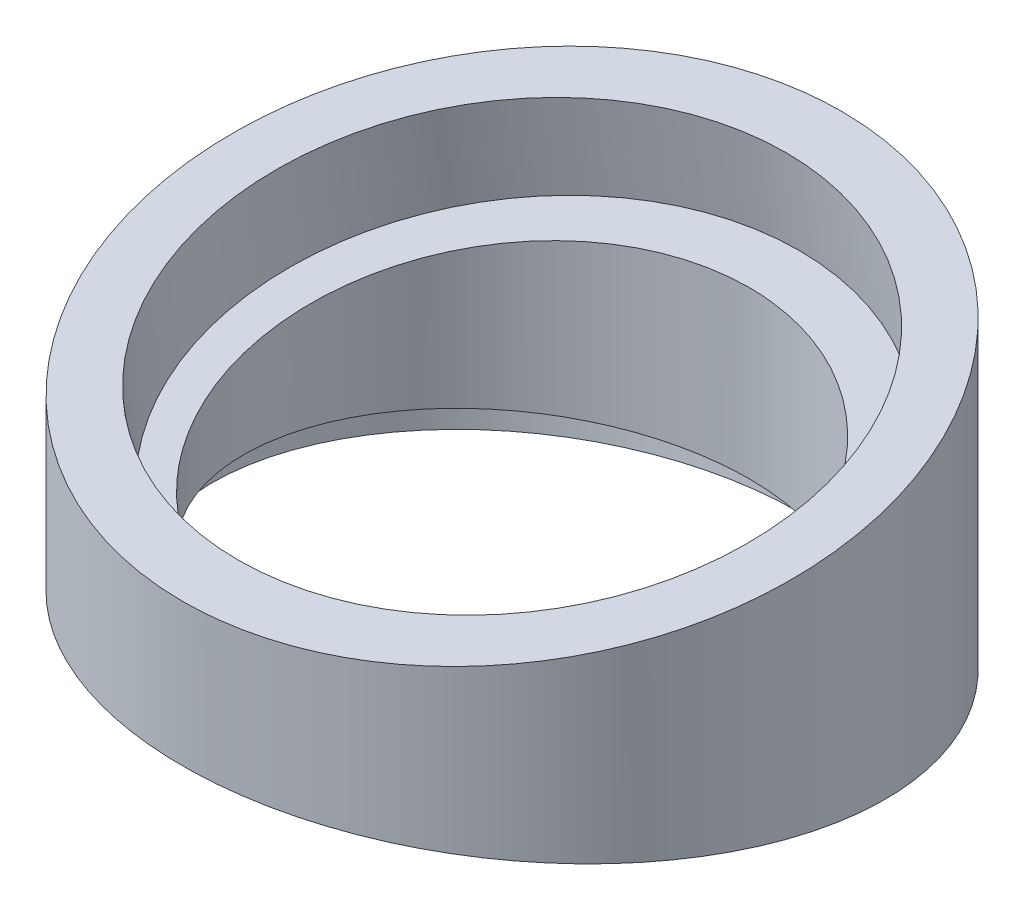
ISO-10303-21;
HEADER;
FILE_DESCRIPTION(('STEP AP214'),'2;1');
FILE_NAME('part.step','',(''),(''),'','','');
FILE_SCHEMA(('AUTOMOTIVE_DESIGN { 1 0 10303 214 1 1 1 1 }'));
ENDSEC;
DATA;
#1=APPLICATION_CONTEXT('core data for automotive mechanical design processes');
#2=APPLICATION_PROTOCOL_DEFINITION('international standard','automotive_design',2000,#1);
#3=PRODUCT_CONTEXT('',#1,'mechanical');
#4=PRODUCT('Part','Part','',(#3));
#5=PRODUCT_RELATED_PRODUCT_CATEGORY('part','',(#4));
#6=PRODUCT_DEFINITION_FORMATION('','',#4);
#7=PRODUCT_DEFINITION_CONTEXT('part definition',#1,'design');
#8=PRODUCT_DEFINITION('design','',#6,#7);
#9=PRODUCT_DEFINITION_SHAPE('','',#8);
#10=(LENGTH_UNIT() NAMED_UNIT(*) SI_UNIT(.MILLI.,.METRE.));
#11=(NAMED_UNIT(*) PLANE_ANGLE_UNIT() SI_UNIT($,.RADIAN.));
#12=(NAMED_UNIT(*) SI_UNIT($,.STERADIAN.) SOLID_ANGLE_UNIT());
#13=UNCERTAINTY_MEASURE_WITH_UNIT(LENGTH_MEASURE(1.E-05),#10,'distance_accuracy_value','');
#14=(GEOMETRIC_REPRESENTATION_CONTEXT(3) GLOBAL_UNCERTAINTY_ASSIGNED_CONTEXT((#13)) GLOBAL_UNIT_ASSIGNED_CONTEXT((#10,
#11,#12)) REPRESENTATION_CONTEXT('',''));
#15=CARTESIAN_POINT('',(0.,0.,0.));
#16=DIRECTION('',(0.,0.,1.));
#17=DIRECTION('',(1.,0.,0.));
#18=AXIS2_PLACEMENT_3D('',#15,#16,#17);
#19=CARTESIAN_POINT('',(0.,30.,0.));
#20=DIRECTION('',(0.,-1.,0.));
#21=DIRECTION('',(0.,0.,-1.));
#22=AXIS2_PLACEMENT_3D('',#19,#20,#21);
#23=CYLINDRICAL_SURFACE('',#22,25.);
#24=CARTESIAN_POINT('',(0.,21.5944492525609,0.));
#25=DIRECTION('',(0.,-0.989821487042019,-0.142314524170676));
#26=DIRECTION('',(0.,-0.142314524170676,0.989821487042019));
#27=AXIS2_PLACEMENT_3D('',#24,#25,#26);
#28=ELLIPSE('',#27,25.2570795110843,25.);
#29=CARTESIAN_POINT('',(0.,18.,25.));
#30=VERTEX_POINT('',#29);
#31=EDGE_CURVE('E10',#30,#30,#28,.T.);
#32=ORIENTED_EDGE('',*,*,#31,.T.);
#33=EDGE_LOOP('',(#32));
#34=FACE_BOUND('',#33,.T.);
#35=CARTESIAN_POINT('',(0.,3.59444925256069,0.));
#36=DIRECTION('',(0.,0.98982148704202,-0.142314524170668));
#37=DIRECTION('',(0.,-0.142314524170668,-0.98982148704202));
#38=AXIS2_PLACEMENT_3D('',#35,#36,#37);
#39=ELLIPSE('',#38,25.2570795110843,25.);
#40=CARTESIAN_POINT('',(0.,0.,-25.));
#41=VERTEX_POINT('',#40);
#42=EDGE_CURVE('E44',#41,#41,#39,.T.);
#43=ORIENTED_EDGE('',*,*,#42,.T.);
#44=EDGE_LOOP('',(#43));
#45=FACE_BOUND('',#44,.T.);
#46=ADVANCED_FACE('F37',(#34,#45),#23,.T.);
#47=CARTESIAN_POINT('',(-31.5,0.,-25.));
#48=DIRECTION('',(0.,0.98982148704202,-0.142314524170668));
#49=DIRECTION('',(0.,0.142314524170668,0.98982148704202));
#50=AXIS2_PLACEMENT_3D('',#47,#48,#49);
#51=PLANE('',#50);
#52=CARTESIAN_POINT('',(0.,3.45213472839003,-0.989821487042017));
#53=DIRECTION('',(0.,-0.98982148704202,0.142314524170668));
#54=DIRECTION('',(0.,-0.142314524170668,-0.98982148704202));
#55=AXIS2_PLACEMENT_3D('',#52,#53,#54);
#56=CIRCLE('',#55,21.);
#57=CARTESIAN_POINT('',(0.,0.463529720805995,-21.7760727149244));
#58=VERTEX_POINT('',#57);
#59=EDGE_CURVE('E57',#58,#58,#56,.T.);
#60=ORIENTED_EDGE('',*,*,#59,.F.);
#61=EDGE_LOOP('',(#60));
#62=FACE_BOUND('',#61,.T.);
#63=ORIENTED_EDGE('',*,*,#42,.F.);
#64=EDGE_LOOP('',(#63));
#65=FACE_BOUND('',#64,.T.);
#66=ADVANCED_FACE('F82',(#62,#65),#51,.F.);
#67=CARTESIAN_POINT('',(-31.5,18.,25.));
#68=DIRECTION('',(0.,-0.989821487042019,-0.142314524170676));
#69=DIRECTION('',(0.,0.142314524170676,-0.989821487042019));
#70=AXIS2_PLACEMENT_3D('',#67,#68,#69);
#71=PLANE('',#70);
#72=CARTESIAN_POINT('',(0.,21.5944492525609,0.));
#73=DIRECTION('',(0.,0.989821487042019,0.142314524170676));
#74=DIRECTION('',(0.,-0.142314524170676,0.989821487042019));
#75=AXIS2_PLACEMENT_3D('',#72,#73,#74);
#76=CIRCLE('',#75,21.);
#77=CARTESIAN_POINT('',(0.,18.6058442449767,20.7862512278824));
#78=VERTEX_POINT('',#77);
#79=EDGE_CURVE('E51',#78,#78,#76,.T.);
#80=ORIENTED_EDGE('',*,*,#79,.F.);
#81=EDGE_LOOP('',(#80));
#82=FACE_BOUND('',#81,.T.);
#83=ORIENTED_EDGE('',*,*,#31,.F.);
#84=EDGE_LOOP('',(#83));
#85=FACE_BOUND('',#84,.T.);
#86=ADVANCED_FACE('F86',(#82,#85),#71,.F.);
#87=CARTESIAN_POINT('',(0.,14.6656988432668,-0.996201669194733));
#88=DIRECTION('',(0.,0.989821487042019,0.142314524170676));
#89=DIRECTION('',(0.,-0.142314524170676,0.989821487042019));
#90=AXIS2_PLACEMENT_3D('',#87,#88,#89);
#91=CYLINDRICAL_SURFACE('',#90,21.);
#92=CARTESIAN_POINT('',(0.,14.6656988432668,-0.996201669194733));
#93=DIRECTION('',(0.,0.989821487042019,0.142314524170676));
#94=DIRECTION('',(0.,-0.142314524170676,0.989821487042019));
#95=AXIS2_PLACEMENT_3D('',#92,#93,#94);
#96=CIRCLE('',#95,21.);
#97=CARTESIAN_POINT('',(0.,11.6770938356826,19.7900495586877));
#98=VERTEX_POINT('',#97);
#99=EDGE_CURVE('E48',#98,#98,#96,.T.);
#100=ORIENTED_EDGE('',*,*,#99,.F.);
#101=EDGE_LOOP('',(#100));
#102=FACE_BOUND('',#101,.T.);
#103=ORIENTED_EDGE('',*,*,#79,.T.);
#104=EDGE_LOOP('',(#103));
#105=FACE_BOUND('',#104,.T.);
#106=ADVANCED_FACE('F94',(#102,#105),#91,.F.);
#107=CARTESIAN_POINT('',(0.,14.6656988432668,-0.996201669194733));
#108=DIRECTION('',(0.,0.989821487042019,0.142314524170676));
#109=DIRECTION('',(0.,-0.142314524170676,0.989821487042019));
#110=AXIS2_PLACEMENT_3D('',#107,#108,#109);
#111=PLANE('',#110);
#112=CARTESIAN_POINT('',(0.,14.5224669894573,0.));
#113=DIRECTION('',(0.,0.989821487042019,0.142314524170676));
#114=DIRECTION('',(0.,-0.142314524170676,0.989821487042019));
#115=AXIS2_PLACEMENT_3D('',#112,#113,#114);
#116=ELLIPSE('',#115,18.1850972479807,18.);
#117=CARTESIAN_POINT('',(0.,11.9344635276134,18.));
#118=VERTEX_POINT('',#117);
#119=EDGE_CURVE('E60',#118,#118,#116,.F.);
#120=ORIENTED_EDGE('',*,*,#119,.T.);
#121=EDGE_LOOP('',(#120));
#122=FACE_BOUND('',#121,.T.);
#123=ORIENTED_EDGE('',*,*,#99,.T.);
#124=EDGE_LOOP('',(#123));
#125=FACE_BOUND('',#124,.T.);
#126=ADVANCED_FACE('F101',(#122,#125),#111,.T.);
#127=CARTESIAN_POINT('',(0.,6.9165099330371,-1.48792232163936));
#128=DIRECTION('',(0.,-0.98982148704202,0.142314524170668));
#129=DIRECTION('',(0.,-0.142314524170668,-0.98982148704202));
#130=AXIS2_PLACEMENT_3D('',#127,#128,#129);
#131=CYLINDRICAL_SURFACE('',#130,21.);
#132=CARTESIAN_POINT('',(0.,6.9165099330371,-1.48792232163936));
#133=DIRECTION('',(0.,-0.98982148704202,0.142314524170668));
#134=DIRECTION('',(0.,-0.142314524170668,-0.98982148704202));
#135=AXIS2_PLACEMENT_3D('',#132,#133,#134);
#136=CIRCLE('',#135,21.);
#137=CARTESIAN_POINT('',(0.,3.92790492545307,-22.2741735495218));
#138=VERTEX_POINT('',#137);
#139=EDGE_CURVE('E54',#138,#138,#136,.T.);
#140=ORIENTED_EDGE('',*,*,#139,.F.);
#141=EDGE_LOOP('',(#140));
#142=FACE_BOUND('',#141,.T.);
#143=ORIENTED_EDGE('',*,*,#59,.T.);
#144=EDGE_LOOP('',(#143));
#145=FACE_BOUND('',#144,.T.);
#146=ADVANCED_FACE('F79',(#142,#145),#131,.F.);
#147=CARTESIAN_POINT('',(0.,6.9165099330371,-1.48792232163936));
#148=DIRECTION('',(0.,-0.98982148704202,0.142314524170668));
#149=DIRECTION('',(0.,-0.142314524170668,-0.98982148704202));
#150=AXIS2_PLACEMENT_3D('',#147,#148,#149);
#151=PLANE('',#150);
#152=CARTESIAN_POINT('',(0.,7.13044038411249,0.));
#153=DIRECTION('',(0.,-0.98982148704202,0.142314524170668));
#154=DIRECTION('',(0.,-0.142314524170668,-0.98982148704202));
#155=AXIS2_PLACEMENT_3D('',#152,#153,#154);
#156=ELLIPSE('',#155,18.1850972479807,18.);
#157=CARTESIAN_POINT('',(0.,4.5424369222688,-18.));
#158=VERTEX_POINT('',#157);
#159=EDGE_CURVE('E40',#158,#158,#156,.F.);
#160=ORIENTED_EDGE('',*,*,#159,.T.);
#161=EDGE_LOOP('',(#160));
#162=FACE_BOUND('',#161,.T.);
#163=ORIENTED_EDGE('',*,*,#139,.T.);
#164=EDGE_LOOP('',(#163));
#165=FACE_BOUND('',#164,.T.);
#166=ADVANCED_FACE('F69',(#162,#165),#151,.T.);
#167=CARTESIAN_POINT('',(0.,107.5,0.));
#168=DIRECTION('',(0.,-1.,0.));
#169=DIRECTION('',(0.,0.,-1.));
#170=AXIS2_PLACEMENT_3D('',#167,#168,#169);
#171=CYLINDRICAL_SURFACE('',#170,18.);
#172=ORIENTED_EDGE('',*,*,#119,.F.);
#173=EDGE_LOOP('',(#172));
#174=FACE_BOUND('',#173,.T.);
#175=ORIENTED_EDGE('',*,*,#159,.F.);
#176=EDGE_LOOP('',(#175));
#177=FACE_BOUND('',#176,.T.);
#178=ADVANCED_FACE('F72',(#174,#177),#171,.F.);
#179=CLOSED_SHELL('',(#46,#66,#86,#106,#126,#146,#166,#178));
#180=MANIFOLD_SOLID_BREP('B2',#179);
#181=ADVANCED_BREP_SHAPE_REPRESENTATION('',(#18,#180),#14);
#182=SHAPE_DEFINITION_REPRESENTATION(#9,#181);
ENDSEC;
END-ISO-10303-21;
